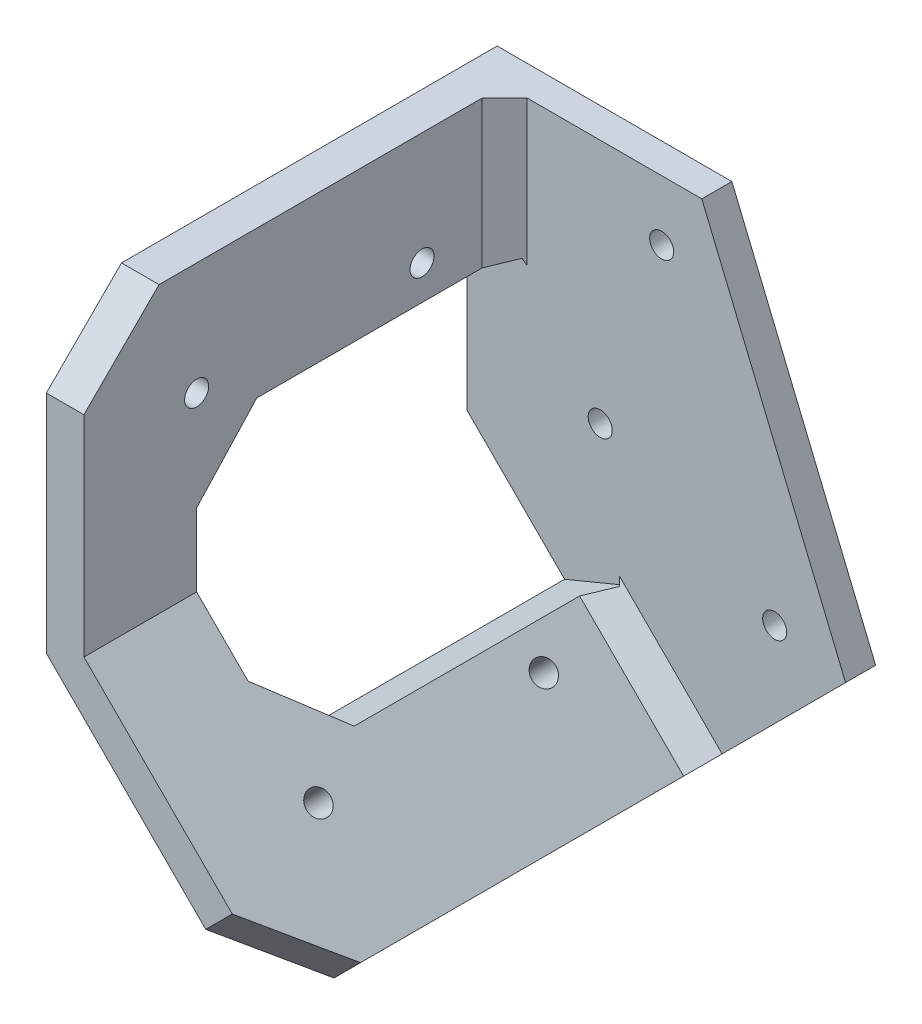
ISO-10303-21;
HEADER;
FILE_DESCRIPTION(('STEP AP214'),'2;1');
FILE_NAME('part.step','',(''),(''),'','','');
FILE_SCHEMA(('AUTOMOTIVE_DESIGN { 1 0 10303 214 1 1 1 1 }'));
ENDSEC;
DATA;
#1=APPLICATION_CONTEXT('core data for automotive mechanical design processes');
#2=APPLICATION_PROTOCOL_DEFINITION('international standard','automotive_design',2000,#1);
#3=PRODUCT_CONTEXT('',#1,'mechanical');
#4=PRODUCT('Part','Part','',(#3));
#5=PRODUCT_RELATED_PRODUCT_CATEGORY('part','',(#4));
#6=PRODUCT_DEFINITION_FORMATION('','',#4);
#7=PRODUCT_DEFINITION_CONTEXT('part definition',#1,'design');
#8=PRODUCT_DEFINITION('design','',#6,#7);
#9=PRODUCT_DEFINITION_SHAPE('','',#8);
#10=(LENGTH_UNIT() NAMED_UNIT(*) SI_UNIT(.MILLI.,.METRE.));
#11=(NAMED_UNIT(*) PLANE_ANGLE_UNIT() SI_UNIT($,.RADIAN.));
#12=(NAMED_UNIT(*) SI_UNIT($,.STERADIAN.) SOLID_ANGLE_UNIT());
#13=UNCERTAINTY_MEASURE_WITH_UNIT(LENGTH_MEASURE(1.E-05),#10,'distance_accuracy_value','');
#14=(GEOMETRIC_REPRESENTATION_CONTEXT(3) GLOBAL_UNCERTAINTY_ASSIGNED_CONTEXT((#13)) GLOBAL_UNIT_ASSIGNED_CONTEXT((#10,
#11,#12)) REPRESENTATION_CONTEXT('',''));
#15=CARTESIAN_POINT('',(0.,0.,0.));
#16=DIRECTION('',(0.,0.,1.));
#17=DIRECTION('',(1.,0.,0.));
#18=AXIS2_PLACEMENT_3D('',#15,#16,#17);
#19=CARTESIAN_POINT('',(-196.715728752538,-203.284271247462,60.));
#20=DIRECTION('',(0.707106781186552,0.707106781186543,0.));
#21=DIRECTION('',(0.707106781186543,-0.707106781186552,0.));
#22=AXIS2_PLACEMENT_3D('',#19,#20,#21);
#23=PLANE('',#22);
#24=CARTESIAN_POINT('',(-207.322330470336,-192.677669529663,15.));
#25=DIRECTION('',(0.707106781186551,0.707106781186544,0.));
#26=DIRECTION('',(-0.707106781186544,0.707106781186551,0.));
#27=AXIS2_PLACEMENT_3D('',#24,#25,#26);
#28=CIRCLE('',#27,1.6);
#29=CARTESIAN_POINT('',(-208.453701320235,-191.546298679765,15.));
#30=VERTEX_POINT('',#29);
#31=EDGE_CURVE('E245',#30,#30,#28,.T.);
#32=ORIENTED_EDGE('',*,*,#31,.T.);
#33=EDGE_LOOP('',(#32));
#34=FACE_BOUND('',#33,.T.);
#35=CARTESIAN_POINT('',(-207.322330470336,-192.677669529663,45.));
#36=DIRECTION('',(0.707106781186551,0.707106781186544,0.));
#37=DIRECTION('',(-0.707106781186544,0.707106781186551,0.));
#38=AXIS2_PLACEMENT_3D('',#35,#36,#37);
#39=CIRCLE('',#38,1.6);
#40=CARTESIAN_POINT('',(-208.453701320235,-191.546298679765,45.));
#41=VERTEX_POINT('',#40);
#42=EDGE_CURVE('E246',#41,#41,#39,.T.);
#43=ORIENTED_EDGE('',*,*,#42,.T.);
#44=EDGE_LOOP('',(#43));
#45=FACE_BOUND('',#44,.T.);
#46=DIRECTION('',(0.707106781186543,-0.707106781186552,0.));
#47=VECTOR('',#46,1.);
#48=CARTESIAN_POINT('',(-196.715728752538,-203.284271247462,45.));
#49=LINE('',#48,#47);
#50=CARTESIAN_POINT('',(-225.,-174.999999999999,45.));
#51=VERTEX_POINT('',#50);
#52=CARTESIAN_POINT('',(-218.146000964983,-181.853999035016,45.));
#53=VERTEX_POINT('',#52);
#54=EDGE_CURVE('E239',#51,#53,#49,.T.);
#55=ORIENTED_EDGE('',*,*,#54,.T.);
#56=DIRECTION('',(0.51937668737614,-0.519376687376146,-0.67859834454585));
#57=VECTOR('',#56,1.);
#58=CARTESIAN_POINT('',(-211.870999643252,-188.129000356748,36.8013156684757));
#59=LINE('',#58,#57);
#60=CARTESIAN_POINT('',(-212.023066047142,-187.976933952858,37.));
#61=VERTEX_POINT('',#60);
#62=EDGE_CURVE('E231',#53,#61,#59,.T.);
#63=ORIENTED_EDGE('',*,*,#62,.T.);
#64=DIRECTION('',(0.,0.,-1.));
#65=VECTOR('',#64,1.);
#66=CARTESIAN_POINT('',(-212.023066047142,-187.976933952858,60.));
#67=LINE('',#66,#65);
#68=CARTESIAN_POINT('',(-212.023066047142,-187.976933952858,4.));
#69=VERTEX_POINT('',#68);
#70=EDGE_CURVE('E223',#61,#69,#67,.T.);
#71=ORIENTED_EDGE('',*,*,#70,.T.);
#72=DIRECTION('',(-0.707106781186543,0.707106781186552,0.));
#73=VECTOR('',#72,1.);
#74=CARTESIAN_POINT('',(-196.715728752538,-203.284271247462,4.));
#75=LINE('',#74,#73);
#76=CARTESIAN_POINT('',(-225.,-174.999999999999,4.));
#77=VERTEX_POINT('',#76);
#78=EDGE_CURVE('E201',#69,#77,#75,.T.);
#79=ORIENTED_EDGE('',*,*,#78,.T.);
#80=DIRECTION('',(0.,0.,-1.));
#81=VECTOR('',#80,1.);
#82=CARTESIAN_POINT('',(-225.,-174.999999999999,60.));
#83=LINE('',#82,#81);
#84=CARTESIAN_POINT('',(-225.,-174.999999999999,0.));
#85=VERTEX_POINT('',#84);
#86=EDGE_CURVE('E332',#77,#85,#83,.T.);
#87=ORIENTED_EDGE('',*,*,#86,.T.);
#88=DIRECTION('',(-0.707106781186543,0.707106781186552,0.));
#89=VECTOR('',#88,1.);
#90=CARTESIAN_POINT('',(-196.715728752538,-203.284271247462,0.));
#91=LINE('',#90,#89);
#92=CARTESIAN_POINT('',(-196.715728752538,-203.284271247462,0.));
#93=VERTEX_POINT('',#92);
#94=EDGE_CURVE('E292',#93,#85,#91,.T.);
#95=ORIENTED_EDGE('',*,*,#94,.F.);
#96=DIRECTION('',(0.,0.,-1.));
#97=VECTOR('',#96,1.);
#98=CARTESIAN_POINT('',(-196.715728752538,-203.284271247462,60.));
#99=LINE('',#98,#97);
#100=CARTESIAN_POINT('',(-196.715728752538,-203.284271247462,50.));
#101=VERTEX_POINT('',#100);
#102=EDGE_CURVE('E308',#101,#93,#99,.T.);
#103=ORIENTED_EDGE('',*,*,#102,.F.);
#104=DIRECTION('',(0.499999999999997,-0.500000000000003,-0.707106781186548));
#105=VECTOR('',#104,1.);
#106=CARTESIAN_POINT('',(-203.786796564403,-196.213203435596,59.9999999999997));
#107=LINE('',#106,#105);
#108=CARTESIAN_POINT('',(-203.786796564404,-196.213203435596,60.));
#109=VERTEX_POINT('',#108);
#110=EDGE_CURVE('E372',#109,#101,#107,.T.);
#111=ORIENTED_EDGE('',*,*,#110,.F.);
#112=DIRECTION('',(-0.707106781186543,0.707106781186552,0.));
#113=VECTOR('',#112,1.);
#114=CARTESIAN_POINT('',(-196.715728752538,-203.284271247462,60.));
#115=LINE('',#114,#113);
#116=CARTESIAN_POINT('',(-225.,-174.999999999999,60.));
#117=VERTEX_POINT('',#116);
#118=EDGE_CURVE('E295',#109,#117,#115,.T.);
#119=ORIENTED_EDGE('',*,*,#118,.T.);
#120=EDGE_CURVE('E333',#117,#51,#83,.T.);
#121=ORIENTED_EDGE('',*,*,#120,.T.);
#122=EDGE_LOOP('',(#55,#63,#71,#79,#87,#95,#103,#111,#119,#121));
#123=FACE_BOUND('',#122,.T.);
#124=ADVANCED_FACE('F37',(#34,#45,#123),#23,.F.);
#125=CARTESIAN_POINT('',(-225.,-174.999999999999,60.));
#126=DIRECTION('',(1.,0.,0.));
#127=DIRECTION('',(0.,0.,1.));
#128=AXIS2_PLACEMENT_3D('',#125,#126,#127);
#129=PLANE('',#128);
#130=CARTESIAN_POINT('',(-225.,-150.,15.));
#131=DIRECTION('',(1.,0.,0.));
#132=DIRECTION('',(0.,0.,-1.));
#133=AXIS2_PLACEMENT_3D('',#130,#131,#132);
#134=CIRCLE('',#133,1.6);
#135=CARTESIAN_POINT('',(-225.,-150.,13.4));
#136=VERTEX_POINT('',#135);
#137=EDGE_CURVE('E256',#136,#136,#134,.T.);
#138=ORIENTED_EDGE('',*,*,#137,.T.);
#139=EDGE_LOOP('',(#138));
#140=FACE_BOUND('',#139,.T.);
#141=CARTESIAN_POINT('',(-225.,-149.999999999999,45.));
#142=DIRECTION('',(1.,0.,0.));
#143=DIRECTION('',(0.,0.,-1.));
#144=AXIS2_PLACEMENT_3D('',#141,#142,#143);
#145=CIRCLE('',#144,1.6);
#146=CARTESIAN_POINT('',(-225.,-149.999999999999,43.4));
#147=VERTEX_POINT('',#146);
#148=EDGE_CURVE('E252',#147,#147,#145,.T.);
#149=ORIENTED_EDGE('',*,*,#148,.T.);
#150=EDGE_LOOP('',(#149));
#151=FACE_BOUND('',#150,.T.);
#152=DIRECTION('',(0.,-1.,0.));
#153=VECTOR('',#152,1.);
#154=CARTESIAN_POINT('',(-225.,-174.999999999999,45.));
#155=LINE('',#154,#153);
#156=CARTESIAN_POINT('',(-225.,-165.306981608187,45.));
#157=VERTEX_POINT('',#156);
#158=EDGE_CURVE('E237',#157,#51,#155,.T.);
#159=ORIENTED_EDGE('',*,*,#158,.T.);
#160=ORIENTED_EDGE('',*,*,#120,.F.);
#161=DIRECTION('',(0.,1.,0.));
#162=VECTOR('',#161,1.);
#163=CARTESIAN_POINT('',(-225.,-174.999999999999,60.));
#164=LINE('',#163,#162);
#165=CARTESIAN_POINT('',(-225.,-144.999999999999,60.));
#166=VERTEX_POINT('',#165);
#167=EDGE_CURVE('E298',#117,#166,#164,.T.);
#168=ORIENTED_EDGE('',*,*,#167,.T.);
#169=DIRECTION('',(0.,-0.707106781186547,0.707106781186548));
#170=VECTOR('',#169,1.);
#171=CARTESIAN_POINT('',(-225.,-144.999999999999,60.));
#172=LINE('',#171,#170);
#173=CARTESIAN_POINT('',(-225.,-134.999999999999,50.));
#174=VERTEX_POINT('',#173);
#175=EDGE_CURVE('E369',#174,#166,#172,.T.);
#176=ORIENTED_EDGE('',*,*,#175,.F.);
#177=DIRECTION('',(0.,0.,-1.));
#178=VECTOR('',#177,1.);
#179=CARTESIAN_POINT('',(-225.,-134.999999999999,60.));
#180=LINE('',#179,#178);
#181=CARTESIAN_POINT('',(-225.,-134.999999999999,0.));
#182=VERTEX_POINT('',#181);
#183=EDGE_CURVE('E329',#174,#182,#180,.T.);
#184=ORIENTED_EDGE('',*,*,#183,.T.);
#185=DIRECTION('',(0.,1.,0.));
#186=VECTOR('',#185,1.);
#187=CARTESIAN_POINT('',(-225.,-174.999999999999,0.));
#188=LINE('',#187,#186);
#189=EDGE_CURVE('E311',#85,#182,#188,.T.);
#190=ORIENTED_EDGE('',*,*,#189,.F.);
#191=ORIENTED_EDGE('',*,*,#86,.F.);
#192=DIRECTION('',(0.,1.,0.));
#193=VECTOR('',#192,1.);
#194=CARTESIAN_POINT('',(-225.,-174.999999999999,4.));
#195=LINE('',#194,#193);
#196=CARTESIAN_POINT('',(-225.,-156.647844005847,4.));
#197=VERTEX_POINT('',#196);
#198=EDGE_CURVE('E52',#77,#197,#195,.T.);
#199=ORIENTED_EDGE('',*,*,#198,.T.);
#200=DIRECTION('',(0.,0.,1.));
#201=VECTOR('',#200,1.);
#202=CARTESIAN_POINT('',(-225.,-156.647844005847,60.));
#203=LINE('',#202,#201);
#204=CARTESIAN_POINT('',(-225.,-156.647844005847,37.));
#205=VERTEX_POINT('',#204);
#206=EDGE_CURVE('E228',#197,#205,#203,.T.);
#207=ORIENTED_EDGE('',*,*,#206,.T.);
#208=DIRECTION('',(0.,-0.734509555267757,0.678598344545845));
#209=VECTOR('',#208,1.);
#210=CARTESIAN_POINT('',(-225.,-178.012961106271,56.7387943987878));
#211=LINE('',#210,#209);
#212=EDGE_CURVE('E242',#205,#157,#211,.T.);
#213=ORIENTED_EDGE('',*,*,#212,.T.);
#214=EDGE_LOOP('',(#159,#160,#168,#176,#184,#190,#191,#199,#207,#213));
#215=FACE_BOUND('',#214,.T.);
#216=ADVANCED_FACE('F423',(#140,#151,#215),#129,.F.);
#217=CARTESIAN_POINT('',(-220.,-134.999999999999,60.));
#218=DIRECTION('',(-1.,0.,0.));
#219=DIRECTION('',(0.,0.,-1.));
#220=AXIS2_PLACEMENT_3D('',#217,#218,#219);
#221=PLANE('',#220);
#222=CARTESIAN_POINT('',(-220.,-150.,15.));
#223=DIRECTION('',(1.,0.,0.));
#224=DIRECTION('',(0.,0.,-1.));
#225=AXIS2_PLACEMENT_3D('',#222,#223,#224);
#226=CIRCLE('',#225,1.6);
#227=CARTESIAN_POINT('',(-220.,-150.,13.4));
#228=VERTEX_POINT('',#227);
#229=EDGE_CURVE('E255',#228,#228,#226,.T.);
#230=ORIENTED_EDGE('',*,*,#229,.F.);
#231=EDGE_LOOP('',(#230));
#232=FACE_BOUND('',#231,.T.);
#233=CARTESIAN_POINT('',(-220.,-149.999999999999,45.));
#234=DIRECTION('',(1.,0.,0.));
#235=DIRECTION('',(0.,0.,-1.));
#236=AXIS2_PLACEMENT_3D('',#233,#234,#235);
#237=CIRCLE('',#236,1.6);
#238=CARTESIAN_POINT('',(-220.,-149.999999999999,43.4));
#239=VERTEX_POINT('',#238);
#240=EDGE_CURVE('E267',#239,#239,#237,.T.);
#241=ORIENTED_EDGE('',*,*,#240,.F.);
#242=EDGE_LOOP('',(#241));
#243=FACE_BOUND('',#242,.T.);
#244=DIRECTION('',(0.,0.,-1.));
#245=VECTOR('',#244,1.);
#246=CARTESIAN_POINT('',(-220.,-154.576776193982,60.));
#247=LINE('',#246,#245);
#248=CARTESIAN_POINT('',(-220.,-154.576776193982,37.));
#249=VERTEX_POINT('',#248);
#250=CARTESIAN_POINT('',(-220.,-154.576776193982,7.00000000000003));
#251=VERTEX_POINT('',#250);
#252=EDGE_CURVE('E225',#249,#251,#247,.T.);
#253=ORIENTED_EDGE('',*,*,#252,.T.);
#254=DIRECTION('',(0.,-1.,0.));
#255=VECTOR('',#254,1.);
#256=CARTESIAN_POINT('',(-220.,-134.999999999999,7.00000000000003));
#257=LINE('',#256,#255);
#258=CARTESIAN_POINT('',(-220.,-134.999999999999,7.00000000000003));
#259=VERTEX_POINT('',#258);
#260=EDGE_CURVE('E344',#259,#251,#257,.T.);
#261=ORIENTED_EDGE('',*,*,#260,.F.);
#262=DIRECTION('',(0.,0.,-1.));
#263=VECTOR('',#262,1.);
#264=CARTESIAN_POINT('',(-220.,-134.999999999999,60.));
#265=LINE('',#264,#263);
#266=CARTESIAN_POINT('',(-220.,-134.999999999999,50.));
#267=VERTEX_POINT('',#266);
#268=EDGE_CURVE('E326',#267,#259,#265,.T.);
#269=ORIENTED_EDGE('',*,*,#268,.F.);
#270=DIRECTION('',(0.,0.707106781186547,-0.707106781186548));
#271=VECTOR('',#270,1.);
#272=CARTESIAN_POINT('',(-220.,-144.999999999999,60.));
#273=LINE('',#272,#271);
#274=CARTESIAN_POINT('',(-220.,-144.999999999999,60.));
#275=VERTEX_POINT('',#274);
#276=EDGE_CURVE('E364',#275,#267,#273,.T.);
#277=ORIENTED_EDGE('',*,*,#276,.F.);
#278=DIRECTION('',(0.,-1.,0.));
#279=VECTOR('',#278,1.);
#280=CARTESIAN_POINT('',(-220.,-134.999999999999,60.));
#281=LINE('',#280,#279);
#282=CARTESIAN_POINT('',(-220.,-172.928932188134,60.));
#283=VERTEX_POINT('',#282);
#284=EDGE_CURVE('E302',#275,#283,#281,.T.);
#285=ORIENTED_EDGE('',*,*,#284,.T.);
#286=DIRECTION('',(0.,0.,-1.));
#287=VECTOR('',#286,1.);
#288=CARTESIAN_POINT('',(-220.,-172.928932188134,60.));
#289=LINE('',#288,#287);
#290=CARTESIAN_POINT('',(-220.,-172.928932188134,45.));
#291=VERTEX_POINT('',#290);
#292=EDGE_CURVE('E323',#283,#291,#289,.T.);
#293=ORIENTED_EDGE('',*,*,#292,.T.);
#294=DIRECTION('',(0.,1.,0.));
#295=VECTOR('',#294,1.);
#296=CARTESIAN_POINT('',(-220.,-134.999999999999,45.));
#297=LINE('',#296,#295);
#298=CARTESIAN_POINT('',(-220.,-163.235913796321,45.));
#299=VERTEX_POINT('',#298);
#300=EDGE_CURVE('E234',#291,#299,#297,.T.);
#301=ORIENTED_EDGE('',*,*,#300,.T.);
#302=DIRECTION('',(0.,0.734509555267757,-0.678598344545845));
#303=VECTOR('',#302,1.);
#304=CARTESIAN_POINT('',(-220.,-155.479071785932,37.8336124296782));
#305=LINE('',#304,#303);
#306=EDGE_CURVE('E11',#299,#249,#305,.T.);
#307=ORIENTED_EDGE('',*,*,#306,.T.);
#308=EDGE_LOOP('',(#253,#261,#269,#277,#285,#293,#301,#307));
#309=FACE_BOUND('',#308,.T.);
#310=ADVANCED_FACE('F399',(#232,#243,#309),#221,.F.);
#311=CARTESIAN_POINT('',(-220.,-172.928932188134,60.));
#312=DIRECTION('',(-0.707106781186547,-0.707106781186547,0.));
#313=DIRECTION('',(-0.707106781186548,0.707106781186548,0.));
#314=AXIS2_PLACEMENT_3D('',#311,#312,#313);
#315=PLANE('',#314);
#316=CARTESIAN_POINT('',(-203.786796564404,-189.14213562373,15.));
#317=DIRECTION('',(0.707106781186547,0.707106781186547,0.));
#318=DIRECTION('',(-0.707106781186548,0.707106781186548,0.));
#319=AXIS2_PLACEMENT_3D('',#316,#317,#318);
#320=CIRCLE('',#319,1.6);
#321=CARTESIAN_POINT('',(-204.918167414302,-188.010764773832,15.));
#322=VERTEX_POINT('',#321);
#323=EDGE_CURVE('E249',#322,#322,#320,.T.);
#324=ORIENTED_EDGE('',*,*,#323,.F.);
#325=EDGE_LOOP('',(#324));
#326=FACE_BOUND('',#325,.T.);
#327=CARTESIAN_POINT('',(-203.786796564404,-189.14213562373,45.));
#328=DIRECTION('',(0.707106781186547,0.707106781186547,0.));
#329=DIRECTION('',(-0.707106781186548,0.707106781186548,0.));
#330=AXIS2_PLACEMENT_3D('',#327,#328,#329);
#331=CIRCLE('',#330,1.6);
#332=CARTESIAN_POINT('',(-204.918167414302,-188.010764773832,45.));
#333=VERTEX_POINT('',#332);
#334=EDGE_CURVE('E259',#333,#333,#331,.T.);
#335=ORIENTED_EDGE('',*,*,#334,.F.);
#336=EDGE_LOOP('',(#335));
#337=FACE_BOUND('',#336,.T.);
#338=DIRECTION('',(-0.707106781186548,0.707106781186548,0.));
#339=VECTOR('',#338,1.);
#340=CARTESIAN_POINT('',(-220.,-172.928932188134,45.));
#341=LINE('',#340,#339);
#342=CARTESIAN_POINT('',(-213.146000964983,-179.782931223151,45.));
#343=VERTEX_POINT('',#342);
#344=EDGE_CURVE('E45',#343,#291,#341,.T.);
#345=ORIENTED_EDGE('',*,*,#344,.T.);
#346=ORIENTED_EDGE('',*,*,#292,.F.);
#347=DIRECTION('',(0.707106781186548,-0.707106781186548,0.));
#348=VECTOR('',#347,1.);
#349=CARTESIAN_POINT('',(-220.,-172.928932188134,60.));
#350=LINE('',#349,#348);
#351=CARTESIAN_POINT('',(-200.251262658471,-192.677669529663,60.));
#352=VERTEX_POINT('',#351);
#353=EDGE_CURVE('E305',#283,#352,#350,.T.);
#354=ORIENTED_EDGE('',*,*,#353,.T.);
#355=DIRECTION('',(-0.5,0.5,0.707106781186548));
#356=VECTOR('',#355,1.);
#357=CARTESIAN_POINT('',(-200.25126265847,-192.677669529664,59.9999999999989));
#358=LINE('',#357,#356);
#359=CARTESIAN_POINT('',(-193.180194846605,-199.748737341529,50.));
#360=VERTEX_POINT('',#359);
#361=EDGE_CURVE('E377',#360,#352,#358,.T.);
#362=ORIENTED_EDGE('',*,*,#361,.F.);
#363=DIRECTION('',(0.,0.,-1.));
#364=VECTOR('',#363,1.);
#365=CARTESIAN_POINT('',(-193.180194846605,-199.748737341529,60.));
#366=LINE('',#365,#364);
#367=CARTESIAN_POINT('',(-193.180194846605,-199.748737341529,7.00000000000003));
#368=VERTEX_POINT('',#367);
#369=EDGE_CURVE('E320',#360,#368,#366,.T.);
#370=ORIENTED_EDGE('',*,*,#369,.T.);
#371=DIRECTION('',(0.707106781186548,-0.707106781186548,0.));
#372=VECTOR('',#371,1.);
#373=CARTESIAN_POINT('',(-220.,-172.928932188134,7.00000000000003));
#374=LINE('',#373,#372);
#375=CARTESIAN_POINT('',(-207.023066047142,-185.905866140992,7.00000000000003));
#376=VERTEX_POINT('',#375);
#377=EDGE_CURVE('E336',#376,#368,#374,.T.);
#378=ORIENTED_EDGE('',*,*,#377,.F.);
#379=DIRECTION('',(0.,0.,1.));
#380=VECTOR('',#379,1.);
#381=CARTESIAN_POINT('',(-207.023066047142,-185.905866140992,60.));
#382=LINE('',#381,#380);
#383=CARTESIAN_POINT('',(-207.023066047142,-185.905866140992,37.));
#384=VERTEX_POINT('',#383);
#385=EDGE_CURVE('E220',#376,#384,#382,.T.);
#386=ORIENTED_EDGE('',*,*,#385,.T.);
#387=DIRECTION('',(-0.519376687376144,0.519376687376144,0.678598344545849));
#388=VECTOR('',#387,1.);
#389=CARTESIAN_POINT('',(-222.130485229696,-170.798446958438,56.7387943987879));
#390=LINE('',#389,#388);
#391=EDGE_CURVE('E385',#384,#343,#390,.T.);
#392=ORIENTED_EDGE('',*,*,#391,.T.);
#393=EDGE_LOOP('',(#345,#346,#354,#362,#370,#378,#386,#392));
#394=FACE_BOUND('',#393,.T.);
#395=ADVANCED_FACE('F391',(#326,#337,#394),#315,.F.);
#396=CARTESIAN_POINT('',(-220.,-134.999999999999,7.00000000000003));
#397=DIRECTION('',(-0.707106781186551,0.,-0.707106781186544));
#398=DIRECTION('',(0.,-1.,0.));
#399=AXIS2_PLACEMENT_3D('',#396,#397,#398);
#400=PLANE('',#399);
#401=DIRECTION('',(0.678598344545844,0.281084637714817,-0.678598344545851));
#402=VECTOR('',#401,1.);
#403=CARTESIAN_POINT('',(-216.265855822986,-153.030043032006,3.2658558229862));
#404=LINE('',#403,#402);
#405=CARTESIAN_POINT('',(-217.346331352698,-153.477590650225,4.34633135269842));
#406=VERTEX_POINT('',#405);
#407=EDGE_CURVE('E382',#251,#406,#404,.T.);
#408=ORIENTED_EDGE('',*,*,#407,.T.);
#409=DIRECTION('',(0.357406744336591,-0.862856209461018,-0.357406744336594));
#410=VECTOR('',#409,1.);
#411=CARTESIAN_POINT('',(-223.722604191027,-138.08390628654,10.7226041910274));
#412=LINE('',#411,#410);
#413=CARTESIAN_POINT('',(-217.,-154.313708498985,3.99999999999999));
#414=VERTEX_POINT('',#413);
#415=EDGE_CURVE('E215',#406,#414,#412,.T.);
#416=ORIENTED_EDGE('',*,*,#415,.T.);
#417=DIRECTION('',(0.,1.,0.));
#418=VECTOR('',#417,1.);
#419=CARTESIAN_POINT('',(-217.,0.,4.));
#420=LINE('',#419,#418);
#421=CARTESIAN_POINT('',(-217.,-134.999999999999,4.));
#422=VERTEX_POINT('',#421);
#423=EDGE_CURVE('E339',#414,#422,#420,.T.);
#424=ORIENTED_EDGE('',*,*,#423,.T.);
#425=DIRECTION('',(-0.707106781186544,0.,0.707106781186551));
#426=VECTOR('',#425,1.);
#427=CARTESIAN_POINT('',(-246.5,-134.999999999999,33.5000000000003));
#428=LINE('',#427,#426);
#429=EDGE_CURVE('E350',#422,#259,#428,.T.);
#430=ORIENTED_EDGE('',*,*,#429,.T.);
#431=ORIENTED_EDGE('',*,*,#260,.T.);
#432=EDGE_LOOP('',(#408,#416,#424,#430,#431));
#433=FACE_BOUND('',#432,.T.);
#434=ADVANCED_FACE('F435',(#433),#400,.F.);
#435=CARTESIAN_POINT('',(-220.,-172.928932188134,7.00000000000003));
#436=DIRECTION('',(-0.500000000000007,-0.500000000000007,-0.707106781186538));
#437=DIRECTION('',(0.707106781186548,-0.707106781186548,0.));
#438=AXIS2_PLACEMENT_3D('',#435,#436,#437);
#439=PLANE('',#438);
#440=DIRECTION('',(-0.67859834454584,-0.281084637714815,0.678598344545857));
#441=VECTOR('',#440,1.);
#442=CARTESIAN_POINT('',(-210.523621795553,-187.355843807828,10.5005557484117));
#443=LINE('',#442,#441);
#444=CARTESIAN_POINT('',(-204.36939739984,-184.806680597236,4.34633135269849));
#445=VERTEX_POINT('',#444);
#446=EDGE_CURVE('E186',#445,#376,#443,.T.);
#447=ORIENTED_EDGE('',*,*,#446,.T.);
#448=ORIENTED_EDGE('',*,*,#377,.T.);
#449=DIRECTION('',(0.499999999999997,0.499999999999989,-0.707106781186557));
#450=VECTOR('',#449,1.);
#451=CARTESIAN_POINT('',(-213.686291501015,-220.254833995938,36.0000000000009));
#452=LINE('',#451,#450);
#453=CARTESIAN_POINT('',(-191.058874503046,-197.627416997969,4.));
#454=VERTEX_POINT('',#453);
#455=EDGE_CURVE('E347',#368,#454,#452,.T.);
#456=ORIENTED_EDGE('',*,*,#455,.T.);
#457=DIRECTION('',(-0.707106781186548,0.707106781186548,0.));
#458=VECTOR('',#457,1.);
#459=CARTESIAN_POINT('',(-194.343145750507,-194.343145750507,4.));
#460=LINE('',#459,#458);
#461=CARTESIAN_POINT('',(-204.715728752539,-183.970562748476,4.));
#462=VERTEX_POINT('',#461);
#463=EDGE_CURVE('E342',#454,#462,#460,.T.);
#464=ORIENTED_EDGE('',*,*,#463,.T.);
#465=DIRECTION('',(0.357406744336589,-0.862856209461014,0.357406744336604));
#466=VECTOR('',#465,1.);
#467=CARTESIAN_POINT('',(-209.690051803188,-171.961484575974,-0.974323050649328));
#468=LINE('',#467,#466);
#469=EDGE_CURVE('E193',#462,#445,#468,.T.);
#470=ORIENTED_EDGE('',*,*,#469,.T.);
#471=EDGE_LOOP('',(#447,#448,#456,#464,#470));
#472=FACE_BOUND('',#471,.T.);
#473=ADVANCED_FACE('F416',(#472),#439,.F.);
#474=CARTESIAN_POINT('',(-220.,-134.999999999999,60.));
#475=DIRECTION('',(0.,-1.,0.));
#476=DIRECTION('',(0.,0.,-1.));
#477=AXIS2_PLACEMENT_3D('',#474,#475,#476);
#478=PLANE('',#477);
#479=ORIENTED_EDGE('',*,*,#268,.T.);
#480=ORIENTED_EDGE('',*,*,#429,.F.);
#481=DIRECTION('',(-1.,0.,0.));
#482=VECTOR('',#481,1.);
#483=CARTESIAN_POINT('',(-225.,-134.999999999999,4.));
#484=LINE('',#483,#482);
#485=CARTESIAN_POINT('',(-193.759605748895,-134.999999999999,4.));
#486=VERTEX_POINT('',#485);
#487=EDGE_CURVE('E285',#486,#422,#484,.T.);
#488=ORIENTED_EDGE('',*,*,#487,.F.);
#489=DIRECTION('',(0.,0.,-1.));
#490=VECTOR('',#489,1.);
#491=CARTESIAN_POINT('',(-193.759605748895,-134.999999999999,4.));
#492=LINE('',#491,#490);
#493=CARTESIAN_POINT('',(-193.759605748895,-134.999999999999,0.));
#494=VERTEX_POINT('',#493);
#495=EDGE_CURVE('E289',#486,#494,#492,.T.);
#496=ORIENTED_EDGE('',*,*,#495,.T.);
#497=DIRECTION('',(1.,0.,0.));
#498=VECTOR('',#497,1.);
#499=CARTESIAN_POINT('',(-220.,-134.999999999999,0.));
#500=LINE('',#499,#498);
#501=EDGE_CURVE('E314',#182,#494,#500,.T.);
#502=ORIENTED_EDGE('',*,*,#501,.F.);
#503=ORIENTED_EDGE('',*,*,#183,.F.);
#504=DIRECTION('',(-1.,0.,0.));
#505=VECTOR('',#504,1.);
#506=CARTESIAN_POINT('',(-225.,-134.999999999999,50.));
#507=LINE('',#506,#505);
#508=EDGE_CURVE('E367',#267,#174,#507,.T.);
#509=ORIENTED_EDGE('',*,*,#508,.F.);
#510=EDGE_LOOP('',(#479,#480,#488,#496,#502,#503,#509));
#511=FACE_BOUND('',#510,.T.);
#512=ADVANCED_FACE('F438',(#511),#478,.F.);
#513=CARTESIAN_POINT('',(-196.715728752538,-203.284271247462,60.));
#514=DIRECTION('',(-0.707106781186542,0.707106781186553,0.));
#515=DIRECTION('',(0.707106781186553,0.707106781186542,0.));
#516=AXIS2_PLACEMENT_3D('',#513,#514,#515);
#517=PLANE('',#516);
#518=ORIENTED_EDGE('',*,*,#102,.T.);
#519=DIRECTION('',(-0.707106781186553,-0.707106781186542,0.));
#520=VECTOR('',#519,1.);
#521=CARTESIAN_POINT('',(-196.715728752538,-203.284271247462,0.));
#522=LINE('',#521,#520);
#523=CARTESIAN_POINT('',(-174.62543413064,-181.193976625564,0.));
#524=VERTEX_POINT('',#523);
#525=EDGE_CURVE('E299',#524,#93,#522,.T.);
#526=ORIENTED_EDGE('',*,*,#525,.F.);
#527=DIRECTION('',(0.,0.,-1.));
#528=VECTOR('',#527,1.);
#529=CARTESIAN_POINT('',(-174.62543413064,-181.193976625564,4.));
#530=LINE('',#529,#528);
#531=CARTESIAN_POINT('',(-174.62543413064,-181.193976625564,4.));
#532=VERTEX_POINT('',#531);
#533=EDGE_CURVE('E287',#532,#524,#530,.T.);
#534=ORIENTED_EDGE('',*,*,#533,.F.);
#535=DIRECTION('',(0.707106781186553,0.707106781186542,0.));
#536=VECTOR('',#535,1.);
#537=CARTESIAN_POINT('',(-174.62543413064,-181.193976625564,4.));
#538=LINE('',#537,#536);
#539=EDGE_CURVE('E280',#454,#532,#538,.T.);
#540=ORIENTED_EDGE('',*,*,#539,.F.);
#541=ORIENTED_EDGE('',*,*,#455,.F.);
#542=ORIENTED_EDGE('',*,*,#369,.F.);
#543=DIRECTION('',(0.707106781186553,0.707106781186542,0.));
#544=VECTOR('',#543,1.);
#545=CARTESIAN_POINT('',(-193.180194846605,-199.748737341529,50.));
#546=LINE('',#545,#544);
#547=EDGE_CURVE('E375',#101,#360,#546,.T.);
#548=ORIENTED_EDGE('',*,*,#547,.F.);
#549=EDGE_LOOP('',(#518,#526,#534,#540,#541,#542,#548));
#550=FACE_BOUND('',#549,.T.);
#551=ADVANCED_FACE('F413',(#550),#517,.F.);
#552=CARTESIAN_POINT('',(0.,0.,60.));
#553=DIRECTION('',(0.,0.,1.));
#554=DIRECTION('',(-1.,0.,0.));
#555=AXIS2_PLACEMENT_3D('',#552,#553,#554);
#556=PLANE('',#555);
#557=ORIENTED_EDGE('',*,*,#167,.F.);
#558=ORIENTED_EDGE('',*,*,#118,.F.);
#559=DIRECTION('',(-0.707106781186553,-0.707106781186542,0.));
#560=VECTOR('',#559,1.);
#561=CARTESIAN_POINT('',(-203.786796564404,-196.213203435596,60.));
#562=LINE('',#561,#560);
#563=EDGE_CURVE('E352',#352,#109,#562,.T.);
#564=ORIENTED_EDGE('',*,*,#563,.F.);
#565=ORIENTED_EDGE('',*,*,#353,.F.);
#566=ORIENTED_EDGE('',*,*,#284,.F.);
#567=DIRECTION('',(1.,0.,0.));
#568=VECTOR('',#567,1.);
#569=CARTESIAN_POINT('',(-220.,-144.999999999999,60.));
#570=LINE('',#569,#568);
#571=EDGE_CURVE('E362',#166,#275,#570,.T.);
#572=ORIENTED_EDGE('',*,*,#571,.F.);
#573=EDGE_LOOP('',(#557,#558,#564,#565,#566,#572));
#574=FACE_BOUND('',#573,.T.);
#575=ADVANCED_FACE('F404',(#574),#556,.T.);
#576=CARTESIAN_POINT('',(0.,0.,0.));
#577=DIRECTION('',(0.,0.,1.));
#578=DIRECTION('',(-1.,0.,0.));
#579=AXIS2_PLACEMENT_3D('',#576,#577,#578);
#580=PLANE('',#579);
#581=ORIENTED_EDGE('',*,*,#94,.T.);
#582=ORIENTED_EDGE('',*,*,#189,.T.);
#583=ORIENTED_EDGE('',*,*,#501,.T.);
#584=DIRECTION('',(-0.382683432365087,0.923879532511288,0.));
#585=VECTOR('',#584,1.);
#586=CARTESIAN_POINT('',(-193.759605748895,-134.999999999999,0.));
#587=LINE('',#586,#585);
#588=EDGE_CURVE('E277',#524,#494,#587,.T.);
#589=ORIENTED_EDGE('',*,*,#588,.F.);
#590=ORIENTED_EDGE('',*,*,#525,.T.);
#591=EDGE_LOOP('',(#581,#582,#583,#589,#590));
#592=FACE_BOUND('',#591,.T.);
#593=CARTESIAN_POINT('',(-199.10503485225,-143.,0.));
#594=DIRECTION('',(0.,0.,1.));
#595=DIRECTION('',(1.,0.,0.));
#596=AXIS2_PLACEMENT_3D('',#593,#594,#595);
#597=CIRCLE('',#596,1.59999999999999);
#598=CARTESIAN_POINT('',(-197.50503485225,-143.,0.));
#599=VERTEX_POINT('',#598);
#600=EDGE_CURVE('E264',#599,#599,#597,.T.);
#601=ORIENTED_EDGE('',*,*,#600,.T.);
#602=EDGE_LOOP('',(#601));
#603=FACE_BOUND('',#602,.T.);
#604=CARTESIAN_POINT('',(-184.062077547467,-179.316911543406,0.));
#605=DIRECTION('',(0.,0.,1.));
#606=DIRECTION('',(1.,0.,0.));
#607=AXIS2_PLACEMENT_3D('',#604,#605,#606);
#608=CIRCLE('',#607,1.59999999999999);
#609=CARTESIAN_POINT('',(-182.462077547467,-179.316911543406,0.));
#610=VERTEX_POINT('',#609);
#611=EDGE_CURVE('E263',#610,#610,#608,.T.);
#612=ORIENTED_EDGE('',*,*,#611,.T.);
#613=EDGE_LOOP('',(#612));
#614=FACE_BOUND('',#613,.T.);
#615=CARTESIAN_POINT('',(-207.28950825255,-167.664074121909,0.));
#616=DIRECTION('',(0.,0.,1.));
#617=DIRECTION('',(1.,0.,0.));
#618=AXIS2_PLACEMENT_3D('',#615,#616,#617);
#619=CIRCLE('',#618,1.59999999999999);
#620=CARTESIAN_POINT('',(-205.68950825255,-167.664074121909,0.));
#621=VERTEX_POINT('',#620);
#622=EDGE_CURVE('E271',#621,#621,#619,.T.);
#623=ORIENTED_EDGE('',*,*,#622,.T.);
#624=EDGE_LOOP('',(#623));
#625=FACE_BOUND('',#624,.T.);
#626=ADVANCED_FACE('F446',(#592,#603,#614,#625),#580,.F.);
#627=CARTESIAN_POINT('',(0.,0.,4.));
#628=DIRECTION('',(0.,0.,1.));
#629=DIRECTION('',(-1.,0.,0.));
#630=AXIS2_PLACEMENT_3D('',#627,#628,#629);
#631=PLANE('',#630);
#632=DIRECTION('',(-0.382683432365087,0.923879532511288,0.));
#633=VECTOR('',#632,1.);
#634=CARTESIAN_POINT('',(-204.36939739984,-184.806680597236,4.));
#635=LINE('',#634,#633);
#636=CARTESIAN_POINT('',(-217.346331352698,-153.477590650225,4.));
#637=VERTEX_POINT('',#636);
#638=EDGE_CURVE('E189',#414,#637,#635,.T.);
#639=ORIENTED_EDGE('',*,*,#638,.T.);
#640=DIRECTION('',(0.923879532511288,0.382683432365087,0.));
#641=VECTOR('',#640,1.);
#642=CARTESIAN_POINT('',(-254.30151265315,-168.784927944829,4.));
#643=LINE('',#642,#641);
#644=EDGE_CURVE('E195',#197,#637,#643,.T.);
#645=ORIENTED_EDGE('',*,*,#644,.F.);
#646=ORIENTED_EDGE('',*,*,#198,.F.);
#647=ORIENTED_EDGE('',*,*,#78,.F.);
#648=DIRECTION('',(0.923879532511288,0.382683432365087,0.));
#649=VECTOR('',#648,1.);
#650=CARTESIAN_POINT('',(-241.324578700292,-200.114017891839,4.));
#651=LINE('',#650,#649);
#652=CARTESIAN_POINT('',(-204.36939739984,-184.806680597236,4.));
#653=VERTEX_POINT('',#652);
#654=EDGE_CURVE('E184',#69,#653,#651,.T.);
#655=ORIENTED_EDGE('',*,*,#654,.T.);
#656=EDGE_CURVE('E59',#653,#462,#635,.T.);
#657=ORIENTED_EDGE('',*,*,#656,.T.);
#658=ORIENTED_EDGE('',*,*,#463,.F.);
#659=ORIENTED_EDGE('',*,*,#539,.T.);
#660=DIRECTION('',(-0.382683432365087,0.923879532511288,0.));
#661=VECTOR('',#660,1.);
#662=CARTESIAN_POINT('',(-193.759605748895,-134.999999999999,4.));
#663=LINE('',#662,#661);
#664=EDGE_CURVE('E283',#532,#486,#663,.T.);
#665=ORIENTED_EDGE('',*,*,#664,.T.);
#666=ORIENTED_EDGE('',*,*,#487,.T.);
#667=ORIENTED_EDGE('',*,*,#423,.F.);
#668=EDGE_LOOP('',(#639,#645,#646,#647,#655,#657,#658,#659,#665,#666,#667));
#669=FACE_BOUND('',#668,.T.);
#670=CARTESIAN_POINT('',(-207.28950825255,-167.664074121909,4.));
#671=DIRECTION('',(0.,0.,1.));
#672=DIRECTION('',(1.,0.,0.));
#673=AXIS2_PLACEMENT_3D('',#670,#671,#672);
#674=CIRCLE('',#673,1.59999999999999);
#675=CARTESIAN_POINT('',(-205.68950825255,-167.664074121909,4.));
#676=VERTEX_POINT('',#675);
#677=EDGE_CURVE('E274',#676,#676,#674,.T.);
#678=ORIENTED_EDGE('',*,*,#677,.F.);
#679=EDGE_LOOP('',(#678));
#680=FACE_BOUND('',#679,.T.);
#681=CARTESIAN_POINT('',(-184.062077547467,-179.316911543406,4.));
#682=DIRECTION('',(0.,0.,1.));
#683=DIRECTION('',(1.,0.,0.));
#684=AXIS2_PLACEMENT_3D('',#681,#682,#683);
#685=CIRCLE('',#684,1.59999999999999);
#686=CARTESIAN_POINT('',(-182.462077547467,-179.316911543406,4.));
#687=VERTEX_POINT('',#686);
#688=EDGE_CURVE('E268',#687,#687,#685,.T.);
#689=ORIENTED_EDGE('',*,*,#688,.F.);
#690=EDGE_LOOP('',(#689));
#691=FACE_BOUND('',#690,.T.);
#692=CARTESIAN_POINT('',(-199.10503485225,-143.,4.));
#693=DIRECTION('',(0.,0.,1.));
#694=DIRECTION('',(1.,0.,0.));
#695=AXIS2_PLACEMENT_3D('',#692,#693,#694);
#696=CIRCLE('',#695,1.59999999999999);
#697=CARTESIAN_POINT('',(-197.50503485225,-143.,4.));
#698=VERTEX_POINT('',#697);
#699=EDGE_CURVE('E260',#698,#698,#696,.T.);
#700=ORIENTED_EDGE('',*,*,#699,.F.);
#701=EDGE_LOOP('',(#700));
#702=FACE_BOUND('',#701,.T.);
#703=ADVANCED_FACE('F198',(#669,#680,#691,#702),#631,.T.);
#704=CARTESIAN_POINT('',(-193.759605748895,-134.999999999999,4.));
#705=DIRECTION('',(0.923879532511288,0.382683432365087,0.));
#706=DIRECTION('',(0.382683432365088,-0.923879532511288,0.));
#707=AXIS2_PLACEMENT_3D('',#704,#705,#706);
#708=PLANE('',#707);
#709=ORIENTED_EDGE('',*,*,#588,.T.);
#710=ORIENTED_EDGE('',*,*,#495,.F.);
#711=ORIENTED_EDGE('',*,*,#664,.F.);
#712=ORIENTED_EDGE('',*,*,#533,.T.);
#713=EDGE_LOOP('',(#709,#710,#711,#712));
#714=FACE_BOUND('',#713,.T.);
#715=ADVANCED_FACE('F450',(#714),#708,.T.);
#716=CARTESIAN_POINT('',(-207.28950825255,-167.664074121909,4.));
#717=DIRECTION('',(0.,0.,-1.));
#718=DIRECTION('',(1.,0.,0.));
#719=AXIS2_PLACEMENT_3D('',#716,#717,#718);
#720=CYLINDRICAL_SURFACE('',#719,1.59999999999999);
#721=ORIENTED_EDGE('',*,*,#677,.T.);
#722=EDGE_LOOP('',(#721));
#723=FACE_BOUND('',#722,.T.);
#724=ORIENTED_EDGE('',*,*,#622,.F.);
#725=EDGE_LOOP('',(#724));
#726=FACE_BOUND('',#725,.T.);
#727=ADVANCED_FACE('F511',(#723,#726),#720,.F.);
#728=CARTESIAN_POINT('',(-184.062077547467,-179.316911543406,4.));
#729=DIRECTION('',(0.,0.,-1.));
#730=DIRECTION('',(1.,0.,0.));
#731=AXIS2_PLACEMENT_3D('',#728,#729,#730);
#732=CYLINDRICAL_SURFACE('',#731,1.59999999999999);
#733=ORIENTED_EDGE('',*,*,#688,.T.);
#734=EDGE_LOOP('',(#733));
#735=FACE_BOUND('',#734,.T.);
#736=ORIENTED_EDGE('',*,*,#611,.F.);
#737=EDGE_LOOP('',(#736));
#738=FACE_BOUND('',#737,.T.);
#739=ADVANCED_FACE('F507',(#735,#738),#732,.F.);
#740=CARTESIAN_POINT('',(-199.10503485225,-143.,4.));
#741=DIRECTION('',(0.,0.,-1.));
#742=DIRECTION('',(1.,0.,0.));
#743=AXIS2_PLACEMENT_3D('',#740,#741,#742);
#744=CYLINDRICAL_SURFACE('',#743,1.59999999999999);
#745=ORIENTED_EDGE('',*,*,#699,.T.);
#746=EDGE_LOOP('',(#745));
#747=FACE_BOUND('',#746,.T.);
#748=ORIENTED_EDGE('',*,*,#600,.F.);
#749=EDGE_LOOP('',(#748));
#750=FACE_BOUND('',#749,.T.);
#751=ADVANCED_FACE('F503',(#747,#750),#744,.F.);
#752=CARTESIAN_POINT('',(-217.,-150.,15.));
#753=DIRECTION('',(-1.,0.,0.));
#754=DIRECTION('',(0.,0.,-1.));
#755=AXIS2_PLACEMENT_3D('',#752,#753,#754);
#756=CYLINDRICAL_SURFACE('',#755,1.6);
#757=ORIENTED_EDGE('',*,*,#137,.F.);
#758=EDGE_LOOP('',(#757));
#759=FACE_BOUND('',#758,.T.);
#760=ORIENTED_EDGE('',*,*,#229,.T.);
#761=EDGE_LOOP('',(#760));
#762=FACE_BOUND('',#761,.T.);
#763=ADVANCED_FACE('F499',(#759,#762),#756,.F.);
#764=CARTESIAN_POINT('',(-217.,-149.999999999999,45.));
#765=DIRECTION('',(-1.,0.,0.));
#766=DIRECTION('',(0.,0.,-1.));
#767=AXIS2_PLACEMENT_3D('',#764,#765,#766);
#768=CYLINDRICAL_SURFACE('',#767,1.6);
#769=ORIENTED_EDGE('',*,*,#148,.F.);
#770=EDGE_LOOP('',(#769));
#771=FACE_BOUND('',#770,.T.);
#772=ORIENTED_EDGE('',*,*,#240,.T.);
#773=EDGE_LOOP('',(#772));
#774=FACE_BOUND('',#773,.T.);
#775=ADVANCED_FACE('F489',(#771,#774),#768,.F.);
#776=CARTESIAN_POINT('',(-201.665476220844,-187.020815280171,15.));
#777=DIRECTION('',(-0.707106781186551,-0.707106781186544,0.));
#778=DIRECTION('',(-0.707106781186544,0.707106781186551,0.));
#779=AXIS2_PLACEMENT_3D('',#776,#777,#778);
#780=CYLINDRICAL_SURFACE('',#779,1.6);
#781=ORIENTED_EDGE('',*,*,#31,.F.);
#782=EDGE_LOOP('',(#781));
#783=FACE_BOUND('',#782,.T.);
#784=ORIENTED_EDGE('',*,*,#323,.T.);
#785=EDGE_LOOP('',(#784));
#786=FACE_BOUND('',#785,.T.);
#787=ADVANCED_FACE('F483',(#783,#786),#780,.F.);
#788=CARTESIAN_POINT('',(-201.665476220844,-187.020815280171,45.));
#789=DIRECTION('',(-0.707106781186551,-0.707106781186544,0.));
#790=DIRECTION('',(-0.707106781186544,0.707106781186551,0.));
#791=AXIS2_PLACEMENT_3D('',#788,#789,#790);
#792=CYLINDRICAL_SURFACE('',#791,1.6);
#793=ORIENTED_EDGE('',*,*,#42,.F.);
#794=EDGE_LOOP('',(#793));
#795=FACE_BOUND('',#794,.T.);
#796=ORIENTED_EDGE('',*,*,#334,.T.);
#797=EDGE_LOOP('',(#796));
#798=FACE_BOUND('',#797,.T.);
#799=ADVANCED_FACE('F478',(#795,#798),#792,.F.);
#800=CARTESIAN_POINT('',(0.,-144.999999999999,60.));
#801=DIRECTION('',(0.,0.707106781186548,0.707106781186547));
#802=DIRECTION('',(-1.,0.,0.));
#803=AXIS2_PLACEMENT_3D('',#800,#801,#802);
#804=PLANE('',#803);
#805=ORIENTED_EDGE('',*,*,#175,.T.);
#806=ORIENTED_EDGE('',*,*,#571,.T.);
#807=ORIENTED_EDGE('',*,*,#276,.T.);
#808=ORIENTED_EDGE('',*,*,#508,.T.);
#809=EDGE_LOOP('',(#805,#806,#807,#808));
#810=FACE_BOUND('',#809,.T.);
#811=ADVANCED_FACE('F442',(#810),#804,.T.);
#812=CARTESIAN_POINT('',(-3.78679656440222,3.78679656440228,60.));
#813=DIRECTION('',(0.499999999999996,-0.500000000000004,0.707106781186547));
#814=DIRECTION('',(0.707106781186553,0.707106781186542,0.));
#815=AXIS2_PLACEMENT_3D('',#812,#813,#814);
#816=PLANE('',#815);
#817=ORIENTED_EDGE('',*,*,#361,.T.);
#818=ORIENTED_EDGE('',*,*,#563,.T.);
#819=ORIENTED_EDGE('',*,*,#110,.T.);
#820=ORIENTED_EDGE('',*,*,#547,.T.);
#821=EDGE_LOOP('',(#817,#818,#819,#820));
#822=FACE_BOUND('',#821,.T.);
#823=ADVANCED_FACE('F39',(#822),#816,.T.);
#824=CARTESIAN_POINT('',(-254.30151265315,-168.784927944829,37.));
#825=DIRECTION('',(0.270598050073096,-0.653281482438187,-0.70710678118655));
#826=DIRECTION('',(0.,0.734509555267757,-0.678598344545845));
#827=AXIS2_PLACEMENT_3D('',#824,#825,#826);
#828=PLANE('',#827);
#829=ORIENTED_EDGE('',*,*,#212,.F.);
#830=DIRECTION('',(0.923879532511288,0.382683432365087,0.));
#831=VECTOR('',#830,1.);
#832=CARTESIAN_POINT('',(-254.30151265315,-168.784927944829,37.));
#833=LINE('',#832,#831);
#834=EDGE_CURVE('E213',#205,#249,#833,.T.);
#835=ORIENTED_EDGE('',*,*,#834,.T.);
#836=ORIENTED_EDGE('',*,*,#306,.F.);
#837=DIRECTION('',(0.923879532511288,0.382683432365087,0.));
#838=VECTOR('',#837,1.);
#839=CARTESIAN_POINT('',(-251.240045194229,-176.175964204919,45.));
#840=LINE('',#839,#838);
#841=EDGE_CURVE('E211',#157,#299,#840,.T.);
#842=ORIENTED_EDGE('',*,*,#841,.F.);
#843=EDGE_LOOP('',(#829,#835,#836,#842));
#844=FACE_BOUND('',#843,.T.);
#845=ADVANCED_FACE('F428',(#844),#828,.T.);
#846=CARTESIAN_POINT('',(-251.240045194229,-176.175964204919,45.));
#847=DIRECTION('',(0.,0.,-1.));
#848=DIRECTION('',(1.,0.,0.));
#849=AXIS2_PLACEMENT_3D('',#846,#847,#848);
#850=PLANE('',#849);
#851=ORIENTED_EDGE('',*,*,#54,.F.);
#852=ORIENTED_EDGE('',*,*,#158,.F.);
#853=ORIENTED_EDGE('',*,*,#841,.T.);
#854=ORIENTED_EDGE('',*,*,#300,.F.);
#855=ORIENTED_EDGE('',*,*,#344,.F.);
#856=DIRECTION('',(0.923879532511288,0.382683432365087,0.));
#857=VECTOR('',#856,1.);
#858=CARTESIAN_POINT('',(-244.386046159212,-192.722981631749,45.));
#859=LINE('',#858,#857);
#860=EDGE_CURVE('E205',#53,#343,#859,.T.);
#861=ORIENTED_EDGE('',*,*,#860,.F.);
#862=EDGE_LOOP('',(#851,#852,#853,#854,#855,#861));
#863=FACE_BOUND('',#862,.T.);
#864=ADVANCED_FACE('F395',(#863),#850,.T.);
#865=CARTESIAN_POINT('',(-244.386046159212,-192.722981631749,45.));
#866=DIRECTION('',(-0.270598050073098,0.653281482438192,-0.707106781186545));
#867=DIRECTION('',(0.,0.734509555267753,0.67859834454585));
#868=AXIS2_PLACEMENT_3D('',#865,#866,#867);
#869=PLANE('',#868);
#870=ORIENTED_EDGE('',*,*,#62,.F.);
#871=ORIENTED_EDGE('',*,*,#860,.T.);
#872=ORIENTED_EDGE('',*,*,#391,.F.);
#873=DIRECTION('',(0.923879532511288,0.382683432365087,0.));
#874=VECTOR('',#873,1.);
#875=CARTESIAN_POINT('',(-241.324578700292,-200.114017891839,37.));
#876=LINE('',#875,#874);
#877=EDGE_CURVE('E203',#61,#384,#876,.T.);
#878=ORIENTED_EDGE('',*,*,#877,.F.);
#879=EDGE_LOOP('',(#870,#871,#872,#878));
#880=FACE_BOUND('',#879,.T.);
#881=ADVANCED_FACE('F419',(#880),#869,.T.);
#882=CARTESIAN_POINT('',(-254.30151265315,-168.784927944829,4.));
#883=DIRECTION('',(0.382683432365087,-0.923879532511288,0.));
#884=DIRECTION('',(-0.923879532511288,-0.382683432365087,0.));
#885=AXIS2_PLACEMENT_3D('',#882,#883,#884);
#886=PLANE('',#885);
#887=ORIENTED_EDGE('',*,*,#206,.F.);
#888=ORIENTED_EDGE('',*,*,#644,.T.);
#889=DIRECTION('',(0.,0.,1.));
#890=VECTOR('',#889,1.);
#891=CARTESIAN_POINT('',(-217.346331352698,-153.477590650225,4.));
#892=LINE('',#891,#890);
#893=EDGE_CURVE('E190',#637,#406,#892,.T.);
#894=ORIENTED_EDGE('',*,*,#893,.T.);
#895=ORIENTED_EDGE('',*,*,#407,.F.);
#896=ORIENTED_EDGE('',*,*,#252,.F.);
#897=ORIENTED_EDGE('',*,*,#834,.F.);
#898=EDGE_LOOP('',(#887,#888,#894,#895,#896,#897));
#899=FACE_BOUND('',#898,.T.);
#900=ADVANCED_FACE('F432',(#899),#886,.T.);
#901=CARTESIAN_POINT('',(-241.324578700292,-200.114017891839,37.));
#902=DIRECTION('',(-0.382683432365087,0.923879532511288,0.));
#903=DIRECTION('',(0.923879532511288,0.382683432365087,0.));
#904=AXIS2_PLACEMENT_3D('',#901,#902,#903);
#905=PLANE('',#904);
#906=ORIENTED_EDGE('',*,*,#70,.F.);
#907=ORIENTED_EDGE('',*,*,#877,.T.);
#908=ORIENTED_EDGE('',*,*,#385,.F.);
#909=ORIENTED_EDGE('',*,*,#446,.F.);
#910=DIRECTION('',(0.,0.,-1.));
#911=VECTOR('',#910,1.);
#912=CARTESIAN_POINT('',(-204.36939739984,-184.806680597236,37.));
#913=LINE('',#912,#911);
#914=EDGE_CURVE('E181',#445,#653,#913,.T.);
#915=ORIENTED_EDGE('',*,*,#914,.T.);
#916=ORIENTED_EDGE('',*,*,#654,.F.);
#917=EDGE_LOOP('',(#906,#907,#908,#909,#915,#916));
#918=FACE_BOUND('',#917,.T.);
#919=ADVANCED_FACE('F183',(#918),#905,.T.);
#920=CARTESIAN_POINT('',(-239.779220613579,-99.3198051533938,0.));
#921=DIRECTION('',(-0.923879532511288,-0.382683432365087,0.));
#922=DIRECTION('',(-0.382683432365087,0.923879532511288,0.));
#923=AXIS2_PLACEMENT_3D('',#920,#921,#922);
#924=PLANE('',#923);
#925=ORIENTED_EDGE('',*,*,#415,.F.);
#926=ORIENTED_EDGE('',*,*,#893,.F.);
#927=ORIENTED_EDGE('',*,*,#638,.F.);
#928=EDGE_LOOP('',(#925,#926,#927));
#929=FACE_BOUND('',#928,.T.);
#930=ADVANCED_FACE('F454',(#929),#924,.T.);
#931=ORIENTED_EDGE('',*,*,#469,.F.);
#932=ORIENTED_EDGE('',*,*,#656,.F.);
#933=ORIENTED_EDGE('',*,*,#914,.F.);
#934=EDGE_LOOP('',(#931,#932,#933));
#935=FACE_BOUND('',#934,.T.);
#936=ADVANCED_FACE('F192',(#935),#924,.T.);
#937=CLOSED_SHELL('',(#124,#216,#310,#395,#434,#473,#512,#551,#575,#626,#703,#715,#727,#739,
#751,#763,#775,#787,#799,#811,#823,#845,#864,#881,#900,#919,#930,#936));
#938=MANIFOLD_SOLID_BREP('B2',#937);
#939=ADVANCED_BREP_SHAPE_REPRESENTATION('',(#18,#938),#14);
#940=SHAPE_DEFINITION_REPRESENTATION(#9,#939);
ENDSEC;
END-ISO-10303-21;
